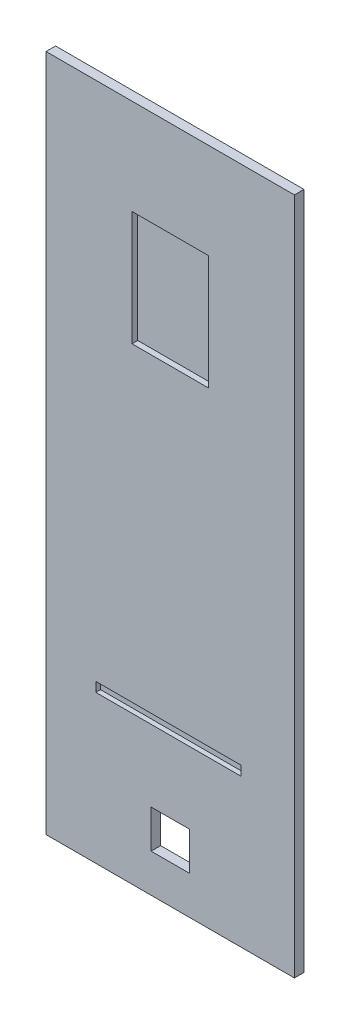
ISO-10303-21;
HEADER;
FILE_DESCRIPTION(('STEP AP214'),'2;1');
FILE_NAME('part.step','',(''),(''),'','','');
FILE_SCHEMA(('AUTOMOTIVE_DESIGN { 1 0 10303 214 1 1 1 1 }'));
ENDSEC;
DATA;
#1=APPLICATION_CONTEXT('core data for automotive mechanical design processes');
#2=APPLICATION_PROTOCOL_DEFINITION('international standard','automotive_design',2000,#1);
#3=PRODUCT_CONTEXT('',#1,'mechanical');
#4=PRODUCT('Part','Part','',(#3));
#5=PRODUCT_RELATED_PRODUCT_CATEGORY('part','',(#4));
#6=PRODUCT_DEFINITION_FORMATION('','',#4);
#7=PRODUCT_DEFINITION_CONTEXT('part definition',#1,'design');
#8=PRODUCT_DEFINITION('design','',#6,#7);
#9=PRODUCT_DEFINITION_SHAPE('','',#8);
#10=(LENGTH_UNIT() NAMED_UNIT(*) SI_UNIT(.MILLI.,.METRE.));
#11=(NAMED_UNIT(*) PLANE_ANGLE_UNIT() SI_UNIT($,.RADIAN.));
#12=(NAMED_UNIT(*) SI_UNIT($,.STERADIAN.) SOLID_ANGLE_UNIT());
#13=UNCERTAINTY_MEASURE_WITH_UNIT(LENGTH_MEASURE(1.E-05),#10,'distance_accuracy_value','');
#14=(GEOMETRIC_REPRESENTATION_CONTEXT(3) GLOBAL_UNCERTAINTY_ASSIGNED_CONTEXT((#13)) GLOBAL_UNIT_ASSIGNED_CONTEXT((#10,
#11,#12)) REPRESENTATION_CONTEXT('',''));
#15=CARTESIAN_POINT('',(0.,0.,0.));
#16=DIRECTION('',(0.,0.,1.));
#17=DIRECTION('',(1.,0.,0.));
#18=AXIS2_PLACEMENT_3D('',#15,#16,#17);
#19=CARTESIAN_POINT('',(0.,0.,12.7));
#20=DIRECTION('',(1.,0.,0.));
#21=DIRECTION('',(0.,0.,-1.));
#22=AXIS2_PLACEMENT_3D('',#19,#20,#21);
#23=PLANE('',#22);
#24=DIRECTION('',(0.,-1.,0.));
#25=VECTOR('',#24,1.);
#26=CARTESIAN_POINT('',(0.,0.,0.));
#27=LINE('',#26,#25);
#28=CARTESIAN_POINT('',(0.,901.7,0.));
#29=VERTEX_POINT('',#28);
#30=CARTESIAN_POINT('',(0.,0.,0.));
#31=VERTEX_POINT('',#30);
#32=EDGE_CURVE('E230',#29,#31,#27,.T.);
#33=ORIENTED_EDGE('',*,*,#32,.T.);
#34=DIRECTION('',(0.,0.,-1.));
#35=VECTOR('',#34,1.);
#36=CARTESIAN_POINT('',(0.,0.,12.7));
#37=LINE('',#36,#35);
#38=CARTESIAN_POINT('',(0.,0.,12.7));
#39=VERTEX_POINT('',#38);
#40=EDGE_CURVE('E263',#39,#31,#37,.T.);
#41=ORIENTED_EDGE('',*,*,#40,.F.);
#42=DIRECTION('',(0.,-1.,0.));
#43=VECTOR('',#42,1.);
#44=CARTESIAN_POINT('',(0.,0.,12.7));
#45=LINE('',#44,#43);
#46=CARTESIAN_POINT('',(0.,901.7,12.7));
#47=VERTEX_POINT('',#46);
#48=EDGE_CURVE('E237',#47,#39,#45,.T.);
#49=ORIENTED_EDGE('',*,*,#48,.F.);
#50=DIRECTION('',(0.,0.,-1.));
#51=VECTOR('',#50,1.);
#52=CARTESIAN_POINT('',(0.,901.7,12.7));
#53=LINE('',#52,#51);
#54=EDGE_CURVE('E247',#47,#29,#53,.T.);
#55=ORIENTED_EDGE('',*,*,#54,.T.);
#56=EDGE_LOOP('',(#33,#41,#49,#55));
#57=FACE_BOUND('',#56,.T.);
#58=ADVANCED_FACE('F32',(#57),#23,.F.);
#59=CARTESIAN_POINT('',(0.,0.,12.7));
#60=DIRECTION('',(0.,1.,0.));
#61=DIRECTION('',(0.,0.,1.));
#62=AXIS2_PLACEMENT_3D('',#59,#60,#61);
#63=PLANE('',#62);
#64=DIRECTION('',(1.,0.,0.));
#65=VECTOR('',#64,1.);
#66=CARTESIAN_POINT('',(0.,0.,0.));
#67=LINE('',#66,#65);
#68=CARTESIAN_POINT('',(330.2,0.,0.));
#69=VERTEX_POINT('',#68);
#70=EDGE_CURVE('E250',#31,#69,#67,.T.);
#71=ORIENTED_EDGE('',*,*,#70,.T.);
#72=DIRECTION('',(0.,0.,-1.));
#73=VECTOR('',#72,1.);
#74=CARTESIAN_POINT('',(330.2,0.,12.7));
#75=LINE('',#74,#73);
#76=CARTESIAN_POINT('',(330.2,0.,12.7));
#77=VERTEX_POINT('',#76);
#78=EDGE_CURVE('E260',#77,#69,#75,.T.);
#79=ORIENTED_EDGE('',*,*,#78,.F.);
#80=DIRECTION('',(1.,0.,0.));
#81=VECTOR('',#80,1.);
#82=CARTESIAN_POINT('',(0.,0.,12.7));
#83=LINE('',#82,#81);
#84=EDGE_CURVE('E240',#39,#77,#83,.T.);
#85=ORIENTED_EDGE('',*,*,#84,.F.);
#86=ORIENTED_EDGE('',*,*,#40,.T.);
#87=EDGE_LOOP('',(#71,#79,#85,#86));
#88=FACE_BOUND('',#87,.T.);
#89=ADVANCED_FACE('F287',(#88),#63,.F.);
#90=CARTESIAN_POINT('',(330.2,0.,12.7));
#91=DIRECTION('',(-1.,0.,0.));
#92=DIRECTION('',(0.,0.,1.));
#93=AXIS2_PLACEMENT_3D('',#90,#91,#92);
#94=PLANE('',#93);
#95=DIRECTION('',(0.,1.,0.));
#96=VECTOR('',#95,1.);
#97=CARTESIAN_POINT('',(330.2,0.,0.));
#98=LINE('',#97,#96);
#99=CARTESIAN_POINT('',(330.2,901.7,0.));
#100=VERTEX_POINT('',#99);
#101=EDGE_CURVE('E252',#69,#100,#98,.T.);
#102=ORIENTED_EDGE('',*,*,#101,.T.);
#103=DIRECTION('',(0.,0.,-1.));
#104=VECTOR('',#103,1.);
#105=CARTESIAN_POINT('',(330.2,901.7,12.7));
#106=LINE('',#105,#104);
#107=CARTESIAN_POINT('',(330.2,901.7,12.7));
#108=VERTEX_POINT('',#107);
#109=EDGE_CURVE('E257',#108,#100,#106,.T.);
#110=ORIENTED_EDGE('',*,*,#109,.F.);
#111=DIRECTION('',(0.,1.,0.));
#112=VECTOR('',#111,1.);
#113=CARTESIAN_POINT('',(330.2,0.,12.7));
#114=LINE('',#113,#112);
#115=EDGE_CURVE('E243',#77,#108,#114,.T.);
#116=ORIENTED_EDGE('',*,*,#115,.F.);
#117=ORIENTED_EDGE('',*,*,#78,.T.);
#118=EDGE_LOOP('',(#102,#110,#116,#117));
#119=FACE_BOUND('',#118,.T.);
#120=ADVANCED_FACE('F292',(#119),#94,.F.);
#121=CARTESIAN_POINT('',(0.,901.7,12.7));
#122=DIRECTION('',(0.,-1.,0.));
#123=DIRECTION('',(0.,0.,-1.));
#124=AXIS2_PLACEMENT_3D('',#121,#122,#123);
#125=PLANE('',#124);
#126=DIRECTION('',(-1.,0.,0.));
#127=VECTOR('',#126,1.);
#128=CARTESIAN_POINT('',(0.,901.7,0.));
#129=LINE('',#128,#127);
#130=EDGE_CURVE('E241',#100,#29,#129,.T.);
#131=ORIENTED_EDGE('',*,*,#130,.T.);
#132=ORIENTED_EDGE('',*,*,#54,.F.);
#133=DIRECTION('',(-1.,0.,0.));
#134=VECTOR('',#133,1.);
#135=CARTESIAN_POINT('',(0.,901.7,12.7));
#136=LINE('',#135,#134);
#137=EDGE_CURVE('E245',#108,#47,#136,.T.);
#138=ORIENTED_EDGE('',*,*,#137,.F.);
#139=ORIENTED_EDGE('',*,*,#109,.T.);
#140=EDGE_LOOP('',(#131,#132,#138,#139));
#141=FACE_BOUND('',#140,.T.);
#142=ADVANCED_FACE('F308',(#141),#125,.F.);
#143=CARTESIAN_POINT('',(0.,0.,12.7));
#144=DIRECTION('',(0.,0.,-1.));
#145=DIRECTION('',(-1.,0.,0.));
#146=AXIS2_PLACEMENT_3D('',#143,#144,#145);
#147=PLANE('',#146);
#148=DIRECTION('',(0.,-1.,0.));
#149=VECTOR('',#148,1.);
#150=CARTESIAN_POINT('',(66.0912776540956,0.,12.7));
#151=LINE('',#150,#149);
#152=CARTESIAN_POINT('',(66.0912776540956,209.55,12.7));
#153=VERTEX_POINT('',#152);
#154=CARTESIAN_POINT('',(66.0912776540956,196.85,12.7));
#155=VERTEX_POINT('',#154);
#156=EDGE_CURVE('E268',#153,#155,#151,.T.);
#157=ORIENTED_EDGE('',*,*,#156,.F.);
#158=DIRECTION('',(1.,0.,0.));
#159=VECTOR('',#158,1.);
#160=CARTESIAN_POINT('',(0.,209.55,12.7));
#161=LINE('',#160,#159);
#162=CARTESIAN_POINT('',(258.984591225424,209.55,12.7));
#163=VERTEX_POINT('',#162);
#164=EDGE_CURVE('E11',#153,#163,#161,.T.);
#165=ORIENTED_EDGE('',*,*,#164,.T.);
#166=DIRECTION('',(0.,1.,0.));
#167=VECTOR('',#166,1.);
#168=CARTESIAN_POINT('',(258.984591225424,0.,12.7));
#169=LINE('',#168,#167);
#170=CARTESIAN_POINT('',(258.984591225424,196.85,12.7));
#171=VERTEX_POINT('',#170);
#172=EDGE_CURVE('E39',#171,#163,#169,.T.);
#173=ORIENTED_EDGE('',*,*,#172,.F.);
#174=DIRECTION('',(1.,0.,0.));
#175=VECTOR('',#174,1.);
#176=CARTESIAN_POINT('',(0.,196.85,12.7));
#177=LINE('',#176,#175);
#178=EDGE_CURVE('E266',#155,#171,#177,.T.);
#179=ORIENTED_EDGE('',*,*,#178,.F.);
#180=EDGE_LOOP('',(#157,#165,#173,#179));
#181=FACE_BOUND('',#180,.T.);
#182=DIRECTION('',(1.,0.,0.));
#183=VECTOR('',#182,1.);
#184=CARTESIAN_POINT('',(139.7,50.8,12.7));
#185=LINE('',#184,#183);
#186=CARTESIAN_POINT('',(139.7,50.8,12.7));
#187=VERTEX_POINT('',#186);
#188=CARTESIAN_POINT('',(190.5,50.8,12.7));
#189=VERTEX_POINT('',#188);
#190=EDGE_CURVE('E189',#187,#189,#185,.T.);
#191=ORIENTED_EDGE('',*,*,#190,.F.);
#192=DIRECTION('',(0.,-1.,0.));
#193=VECTOR('',#192,1.);
#194=CARTESIAN_POINT('',(139.7,101.6,12.7));
#195=LINE('',#194,#193);
#196=CARTESIAN_POINT('',(139.7,101.6,12.7));
#197=VERTEX_POINT('',#196);
#198=EDGE_CURVE('E54',#197,#187,#195,.T.);
#199=ORIENTED_EDGE('',*,*,#198,.F.);
#200=DIRECTION('',(-1.,0.,0.));
#201=VECTOR('',#200,1.);
#202=CARTESIAN_POINT('',(139.7,101.6,12.7));
#203=LINE('',#202,#201);
#204=CARTESIAN_POINT('',(190.5,101.6,12.7));
#205=VERTEX_POINT('',#204);
#206=EDGE_CURVE('E178',#205,#197,#203,.T.);
#207=ORIENTED_EDGE('',*,*,#206,.F.);
#208=DIRECTION('',(0.,1.,0.));
#209=VECTOR('',#208,1.);
#210=CARTESIAN_POINT('',(190.5,101.6,12.7));
#211=LINE('',#210,#209);
#212=EDGE_CURVE('E192',#189,#205,#211,.T.);
#213=ORIENTED_EDGE('',*,*,#212,.F.);
#214=EDGE_LOOP('',(#191,#199,#207,#213));
#215=FACE_BOUND('',#214,.T.);
#216=DIRECTION('',(-1.,0.,0.));
#217=VECTOR('',#216,1.);
#218=CARTESIAN_POINT('',(114.3,774.7,12.7));
#219=LINE('',#218,#217);
#220=CARTESIAN_POINT('',(215.9,774.7,12.7));
#221=VERTEX_POINT('',#220);
#222=CARTESIAN_POINT('',(114.3,774.7,12.7));
#223=VERTEX_POINT('',#222);
#224=EDGE_CURVE('E220',#221,#223,#219,.T.);
#225=ORIENTED_EDGE('',*,*,#224,.F.);
#226=DIRECTION('',(0.,1.,0.));
#227=VECTOR('',#226,1.);
#228=CARTESIAN_POINT('',(215.9,774.7,12.7));
#229=LINE('',#228,#227);
#230=CARTESIAN_POINT('',(215.9,622.3,12.7));
#231=VERTEX_POINT('',#230);
#232=EDGE_CURVE('E199',#231,#221,#229,.T.);
#233=ORIENTED_EDGE('',*,*,#232,.F.);
#234=DIRECTION('',(1.,0.,0.));
#235=VECTOR('',#234,1.);
#236=CARTESIAN_POINT('',(114.3,622.3,12.7));
#237=LINE('',#236,#235);
#238=CARTESIAN_POINT('',(114.3,622.3,12.7));
#239=VERTEX_POINT('',#238);
#240=EDGE_CURVE('E209',#239,#231,#237,.T.);
#241=ORIENTED_EDGE('',*,*,#240,.F.);
#242=DIRECTION('',(0.,-1.,0.));
#243=VECTOR('',#242,1.);
#244=CARTESIAN_POINT('',(114.3,774.7,12.7));
#245=LINE('',#244,#243);
#246=EDGE_CURVE('E223',#223,#239,#245,.T.);
#247=ORIENTED_EDGE('',*,*,#246,.F.);
#248=EDGE_LOOP('',(#225,#233,#241,#247));
#249=FACE_BOUND('',#248,.T.);
#250=ORIENTED_EDGE('',*,*,#48,.T.);
#251=ORIENTED_EDGE('',*,*,#84,.T.);
#252=ORIENTED_EDGE('',*,*,#115,.T.);
#253=ORIENTED_EDGE('',*,*,#137,.T.);
#254=EDGE_LOOP('',(#250,#251,#252,#253));
#255=FACE_BOUND('',#254,.T.);
#256=ADVANCED_FACE('F274',(#181,#215,#249,#255),#147,.F.);
#257=CARTESIAN_POINT('',(0.,0.,0.));
#258=DIRECTION('',(0.,0.,-1.));
#259=DIRECTION('',(-1.,0.,0.));
#260=AXIS2_PLACEMENT_3D('',#257,#258,#259);
#261=PLANE('',#260);
#262=DIRECTION('',(0.,-1.,0.));
#263=VECTOR('',#262,1.);
#264=CARTESIAN_POINT('',(139.7,101.6,0.));
#265=LINE('',#264,#263);
#266=CARTESIAN_POINT('',(139.7,101.6,0.));
#267=VERTEX_POINT('',#266);
#268=CARTESIAN_POINT('',(139.7,50.8,0.));
#269=VERTEX_POINT('',#268);
#270=EDGE_CURVE('E174',#267,#269,#265,.T.);
#271=ORIENTED_EDGE('',*,*,#270,.T.);
#272=DIRECTION('',(1.,0.,0.));
#273=VECTOR('',#272,1.);
#274=CARTESIAN_POINT('',(139.7,50.8,0.));
#275=LINE('',#274,#273);
#276=CARTESIAN_POINT('',(190.5,50.8,0.));
#277=VERTEX_POINT('',#276);
#278=EDGE_CURVE('E177',#269,#277,#275,.T.);
#279=ORIENTED_EDGE('',*,*,#278,.T.);
#280=DIRECTION('',(0.,1.,0.));
#281=VECTOR('',#280,1.);
#282=CARTESIAN_POINT('',(190.5,101.6,0.));
#283=LINE('',#282,#281);
#284=CARTESIAN_POINT('',(190.5,101.6,0.));
#285=VERTEX_POINT('',#284);
#286=EDGE_CURVE('E181',#277,#285,#283,.T.);
#287=ORIENTED_EDGE('',*,*,#286,.T.);
#288=DIRECTION('',(-1.,0.,0.));
#289=VECTOR('',#288,1.);
#290=CARTESIAN_POINT('',(139.7,101.6,0.));
#291=LINE('',#290,#289);
#292=EDGE_CURVE('E184',#285,#267,#291,.T.);
#293=ORIENTED_EDGE('',*,*,#292,.T.);
#294=EDGE_LOOP('',(#271,#279,#287,#293));
#295=FACE_BOUND('',#294,.T.);
#296=ORIENTED_EDGE('',*,*,#32,.F.);
#297=ORIENTED_EDGE('',*,*,#130,.F.);
#298=ORIENTED_EDGE('',*,*,#101,.F.);
#299=ORIENTED_EDGE('',*,*,#70,.F.);
#300=EDGE_LOOP('',(#296,#297,#298,#299));
#301=FACE_BOUND('',#300,.T.);
#302=ADVANCED_FACE('F300',(#295,#301),#261,.T.);
#303=CARTESIAN_POINT('',(215.9,774.7,5.08));
#304=DIRECTION('',(1.,0.,0.));
#305=DIRECTION('',(0.,1.,0.));
#306=AXIS2_PLACEMENT_3D('',#303,#304,#305);
#307=PLANE('',#306);
#308=ORIENTED_EDGE('',*,*,#232,.T.);
#309=DIRECTION('',(0.,0.,1.));
#310=VECTOR('',#309,1.);
#311=CARTESIAN_POINT('',(215.9,774.7,5.08));
#312=LINE('',#311,#310);
#313=CARTESIAN_POINT('',(215.9,774.7,5.08));
#314=VERTEX_POINT('',#313);
#315=EDGE_CURVE('E218',#314,#221,#312,.T.);
#316=ORIENTED_EDGE('',*,*,#315,.F.);
#317=DIRECTION('',(0.,1.,0.));
#318=VECTOR('',#317,1.);
#319=CARTESIAN_POINT('',(215.9,774.7,5.08));
#320=LINE('',#319,#318);
#321=CARTESIAN_POINT('',(215.9,622.3,5.08));
#322=VERTEX_POINT('',#321);
#323=EDGE_CURVE('E205',#322,#314,#320,.T.);
#324=ORIENTED_EDGE('',*,*,#323,.F.);
#325=DIRECTION('',(0.,0.,1.));
#326=VECTOR('',#325,1.);
#327=CARTESIAN_POINT('',(215.9,622.3,5.08));
#328=LINE('',#327,#326);
#329=EDGE_CURVE('E228',#322,#231,#328,.T.);
#330=ORIENTED_EDGE('',*,*,#329,.T.);
#331=EDGE_LOOP('',(#308,#316,#324,#330));
#332=FACE_BOUND('',#331,.T.);
#333=ADVANCED_FACE('F319',(#332),#307,.F.);
#334=CARTESIAN_POINT('',(114.3,622.3,5.08));
#335=DIRECTION('',(0.,-1.,0.));
#336=DIRECTION('',(0.,0.,-1.));
#337=AXIS2_PLACEMENT_3D('',#334,#335,#336);
#338=PLANE('',#337);
#339=ORIENTED_EDGE('',*,*,#240,.T.);
#340=ORIENTED_EDGE('',*,*,#329,.F.);
#341=DIRECTION('',(1.,0.,0.));
#342=VECTOR('',#341,1.);
#343=CARTESIAN_POINT('',(114.3,622.3,5.08));
#344=LINE('',#343,#342);
#345=CARTESIAN_POINT('',(114.3,622.3,5.08));
#346=VERTEX_POINT('',#345);
#347=EDGE_CURVE('E215',#346,#322,#344,.T.);
#348=ORIENTED_EDGE('',*,*,#347,.F.);
#349=DIRECTION('',(0.,0.,1.));
#350=VECTOR('',#349,1.);
#351=CARTESIAN_POINT('',(114.3,622.3,5.08));
#352=LINE('',#351,#350);
#353=EDGE_CURVE('E231',#346,#239,#352,.T.);
#354=ORIENTED_EDGE('',*,*,#353,.T.);
#355=EDGE_LOOP('',(#339,#340,#348,#354));
#356=FACE_BOUND('',#355,.T.);
#357=ADVANCED_FACE('F325',(#356),#338,.F.);
#358=CARTESIAN_POINT('',(114.3,774.7,5.08));
#359=DIRECTION('',(-1.,0.,0.));
#360=DIRECTION('',(0.,-1.,0.));
#361=AXIS2_PLACEMENT_3D('',#358,#359,#360);
#362=PLANE('',#361);
#363=ORIENTED_EDGE('',*,*,#246,.T.);
#364=ORIENTED_EDGE('',*,*,#353,.F.);
#365=DIRECTION('',(0.,-1.,0.));
#366=VECTOR('',#365,1.);
#367=CARTESIAN_POINT('',(114.3,774.7,5.08));
#368=LINE('',#367,#366);
#369=CARTESIAN_POINT('',(114.3,774.7,5.08));
#370=VERTEX_POINT('',#369);
#371=EDGE_CURVE('E212',#370,#346,#368,.T.);
#372=ORIENTED_EDGE('',*,*,#371,.F.);
#373=DIRECTION('',(0.,0.,1.));
#374=VECTOR('',#373,1.);
#375=CARTESIAN_POINT('',(114.3,774.7,5.08));
#376=LINE('',#375,#374);
#377=EDGE_CURVE('E233',#370,#223,#376,.T.);
#378=ORIENTED_EDGE('',*,*,#377,.T.);
#379=EDGE_LOOP('',(#363,#364,#372,#378));
#380=FACE_BOUND('',#379,.T.);
#381=ADVANCED_FACE('F331',(#380),#362,.F.);
#382=CARTESIAN_POINT('',(114.3,774.7,5.08));
#383=DIRECTION('',(0.,1.,0.));
#384=DIRECTION('',(0.,0.,1.));
#385=AXIS2_PLACEMENT_3D('',#382,#383,#384);
#386=PLANE('',#385);
#387=ORIENTED_EDGE('',*,*,#224,.T.);
#388=ORIENTED_EDGE('',*,*,#377,.F.);
#389=DIRECTION('',(-1.,0.,0.));
#390=VECTOR('',#389,1.);
#391=CARTESIAN_POINT('',(114.3,774.7,5.08));
#392=LINE('',#391,#390);
#393=EDGE_CURVE('E208',#314,#370,#392,.T.);
#394=ORIENTED_EDGE('',*,*,#393,.F.);
#395=ORIENTED_EDGE('',*,*,#315,.T.);
#396=EDGE_LOOP('',(#387,#388,#394,#395));
#397=FACE_BOUND('',#396,.T.);
#398=ADVANCED_FACE('F327',(#397),#386,.F.);
#399=CARTESIAN_POINT('',(0.,0.,5.08));
#400=DIRECTION('',(0.,0.,1.));
#401=DIRECTION('',(1.,0.,0.));
#402=AXIS2_PLACEMENT_3D('',#399,#400,#401);
#403=PLANE('',#402);
#404=ORIENTED_EDGE('',*,*,#323,.T.);
#405=ORIENTED_EDGE('',*,*,#393,.T.);
#406=ORIENTED_EDGE('',*,*,#371,.T.);
#407=ORIENTED_EDGE('',*,*,#347,.T.);
#408=EDGE_LOOP('',(#404,#405,#406,#407));
#409=FACE_BOUND('',#408,.T.);
#410=ADVANCED_FACE('F330',(#409),#403,.T.);
#411=CARTESIAN_POINT('',(139.7,101.6,0.));
#412=DIRECTION('',(-1.,0.,0.));
#413=DIRECTION('',(0.,-1.,0.));
#414=AXIS2_PLACEMENT_3D('',#411,#412,#413);
#415=PLANE('',#414);
#416=ORIENTED_EDGE('',*,*,#198,.T.);
#417=DIRECTION('',(0.,0.,1.));
#418=VECTOR('',#417,1.);
#419=CARTESIAN_POINT('',(139.7,50.8,0.));
#420=LINE('',#419,#418);
#421=EDGE_CURVE('E187',#269,#187,#420,.T.);
#422=ORIENTED_EDGE('',*,*,#421,.F.);
#423=ORIENTED_EDGE('',*,*,#270,.F.);
#424=DIRECTION('',(0.,0.,1.));
#425=VECTOR('',#424,1.);
#426=CARTESIAN_POINT('',(139.7,101.6,0.));
#427=LINE('',#426,#425);
#428=EDGE_CURVE('E197',#267,#197,#427,.T.);
#429=ORIENTED_EDGE('',*,*,#428,.T.);
#430=EDGE_LOOP('',(#416,#422,#423,#429));
#431=FACE_BOUND('',#430,.T.);
#432=ADVANCED_FACE('F341',(#431),#415,.F.);
#433=CARTESIAN_POINT('',(139.7,101.6,0.));
#434=DIRECTION('',(0.,1.,0.));
#435=DIRECTION('',(0.,0.,1.));
#436=AXIS2_PLACEMENT_3D('',#433,#434,#435);
#437=PLANE('',#436);
#438=ORIENTED_EDGE('',*,*,#206,.T.);
#439=ORIENTED_EDGE('',*,*,#428,.F.);
#440=ORIENTED_EDGE('',*,*,#292,.F.);
#441=DIRECTION('',(0.,0.,1.));
#442=VECTOR('',#441,1.);
#443=CARTESIAN_POINT('',(190.5,101.6,0.));
#444=LINE('',#443,#442);
#445=EDGE_CURVE('E200',#285,#205,#444,.T.);
#446=ORIENTED_EDGE('',*,*,#445,.T.);
#447=EDGE_LOOP('',(#438,#439,#440,#446));
#448=FACE_BOUND('',#447,.T.);
#449=ADVANCED_FACE('F345',(#448),#437,.F.);
#450=CARTESIAN_POINT('',(190.5,101.6,0.));
#451=DIRECTION('',(1.,0.,0.));
#452=DIRECTION('',(0.,0.,-1.));
#453=AXIS2_PLACEMENT_3D('',#450,#451,#452);
#454=PLANE('',#453);
#455=ORIENTED_EDGE('',*,*,#212,.T.);
#456=ORIENTED_EDGE('',*,*,#445,.F.);
#457=ORIENTED_EDGE('',*,*,#286,.F.);
#458=DIRECTION('',(0.,0.,1.));
#459=VECTOR('',#458,1.);
#460=CARTESIAN_POINT('',(190.5,50.8,0.));
#461=LINE('',#460,#459);
#462=EDGE_CURVE('E202',#277,#189,#461,.T.);
#463=ORIENTED_EDGE('',*,*,#462,.T.);
#464=EDGE_LOOP('',(#455,#456,#457,#463));
#465=FACE_BOUND('',#464,.T.);
#466=ADVANCED_FACE('F349',(#465),#454,.F.);
#467=CARTESIAN_POINT('',(139.7,50.8,0.));
#468=DIRECTION('',(0.,-1.,0.));
#469=DIRECTION('',(0.,0.,-1.));
#470=AXIS2_PLACEMENT_3D('',#467,#468,#469);
#471=PLANE('',#470);
#472=ORIENTED_EDGE('',*,*,#190,.T.);
#473=ORIENTED_EDGE('',*,*,#462,.F.);
#474=ORIENTED_EDGE('',*,*,#278,.F.);
#475=ORIENTED_EDGE('',*,*,#421,.T.);
#476=EDGE_LOOP('',(#472,#473,#474,#475));
#477=FACE_BOUND('',#476,.T.);
#478=ADVANCED_FACE('F346',(#477),#471,.F.);
#479=CARTESIAN_POINT('',(258.984591225424,209.55,12.7481867422834));
#480=DIRECTION('',(-1.,0.,0.));
#481=DIRECTION('',(0.,1.,0.));
#482=AXIS2_PLACEMENT_3D('',#479,#480,#481);
#483=PLANE('',#482);
#484=ORIENTED_EDGE('',*,*,#172,.T.);
#485=DIRECTION('',(0.,0.,-1.));
#486=VECTOR('',#485,1.);
#487=CARTESIAN_POINT('',(258.984591225424,209.55,12.7481867422834));
#488=LINE('',#487,#486);
#489=CARTESIAN_POINT('',(258.984591225424,209.55,6.39818674228332));
#490=VERTEX_POINT('',#489);
#491=EDGE_CURVE('E144',#163,#490,#488,.T.);
#492=ORIENTED_EDGE('',*,*,#491,.T.);
#493=DIRECTION('',(0.,-1.,0.));
#494=VECTOR('',#493,1.);
#495=CARTESIAN_POINT('',(258.984591225424,209.55,6.39818674228332));
#496=LINE('',#495,#494);
#497=CARTESIAN_POINT('',(258.984591225424,196.85,6.39818674228332));
#498=VERTEX_POINT('',#497);
#499=EDGE_CURVE('E148',#490,#498,#496,.T.);
#500=ORIENTED_EDGE('',*,*,#499,.T.);
#501=DIRECTION('',(0.,0.,-1.));
#502=VECTOR('',#501,1.);
#503=CARTESIAN_POINT('',(258.984591225424,196.85,12.7481867422834));
#504=LINE('',#503,#502);
#505=EDGE_CURVE('E169',#171,#498,#504,.T.);
#506=ORIENTED_EDGE('',*,*,#505,.F.);
#507=EDGE_LOOP('',(#484,#492,#500,#506));
#508=FACE_BOUND('',#507,.T.);
#509=ADVANCED_FACE('F146',(#508),#483,.T.);
#510=CARTESIAN_POINT('',(66.0912776540956,209.55,12.7481867422834));
#511=DIRECTION('',(1.,0.,0.));
#512=DIRECTION('',(0.,0.,-1.));
#513=AXIS2_PLACEMENT_3D('',#510,#511,#512);
#514=PLANE('',#513);
#515=ORIENTED_EDGE('',*,*,#156,.T.);
#516=DIRECTION('',(0.,0.,1.));
#517=VECTOR('',#516,1.);
#518=CARTESIAN_POINT('',(66.0912776540956,196.85,12.7481867422834));
#519=LINE('',#518,#517);
#520=CARTESIAN_POINT('',(66.0912776540956,196.85,6.39818674228332));
#521=VERTEX_POINT('',#520);
#522=EDGE_CURVE('E46',#521,#155,#519,.T.);
#523=ORIENTED_EDGE('',*,*,#522,.F.);
#524=DIRECTION('',(0.,-1.,0.));
#525=VECTOR('',#524,1.);
#526=CARTESIAN_POINT('',(66.0912776540956,209.55,6.39818674228332));
#527=LINE('',#526,#525);
#528=CARTESIAN_POINT('',(66.0912776540956,209.55,6.39818674228332));
#529=VERTEX_POINT('',#528);
#530=EDGE_CURVE('E160',#529,#521,#527,.T.);
#531=ORIENTED_EDGE('',*,*,#530,.F.);
#532=DIRECTION('',(0.,0.,1.));
#533=VECTOR('',#532,1.);
#534=CARTESIAN_POINT('',(66.0912776540956,209.55,12.7481867422834));
#535=LINE('',#534,#533);
#536=EDGE_CURVE('E165',#529,#153,#535,.T.);
#537=ORIENTED_EDGE('',*,*,#536,.T.);
#538=EDGE_LOOP('',(#515,#523,#531,#537));
#539=FACE_BOUND('',#538,.T.);
#540=ADVANCED_FACE('F272',(#539),#514,.T.);
#541=CARTESIAN_POINT('',(-424.71544632442,209.55,1072.6673051735));
#542=DIRECTION('',(0.,1.,0.));
#543=DIRECTION('',(1.,0.,0.));
#544=AXIS2_PLACEMENT_3D('',#541,#542,#543);
#545=PLANE('',#544);
#546=ORIENTED_EDGE('',*,*,#536,.F.);
#547=DIRECTION('',(-1.,0.,0.));
#548=VECTOR('',#547,1.);
#549=CARTESIAN_POINT('',(258.984591225424,209.55,6.39818674228332));
#550=LINE('',#549,#548);
#551=EDGE_CURVE('E153',#490,#529,#550,.T.);
#552=ORIENTED_EDGE('',*,*,#551,.F.);
#553=ORIENTED_EDGE('',*,*,#491,.F.);
#554=ORIENTED_EDGE('',*,*,#164,.F.);
#555=EDGE_LOOP('',(#546,#552,#553,#554));
#556=FACE_BOUND('',#555,.T.);
#557=ADVANCED_FACE('F163',(#556),#545,.F.);
#558=CARTESIAN_POINT('',(-424.71544632442,196.85,1072.6673051735));
#559=DIRECTION('',(0.,1.,0.));
#560=DIRECTION('',(1.,0.,0.));
#561=AXIS2_PLACEMENT_3D('',#558,#559,#560);
#562=PLANE('',#561);
#563=ORIENTED_EDGE('',*,*,#178,.T.);
#564=ORIENTED_EDGE('',*,*,#505,.T.);
#565=DIRECTION('',(-1.,0.,0.));
#566=VECTOR('',#565,1.);
#567=CARTESIAN_POINT('',(258.984591225424,196.85,6.39818674228332));
#568=LINE('',#567,#566);
#569=EDGE_CURVE('E159',#498,#521,#568,.T.);
#570=ORIENTED_EDGE('',*,*,#569,.T.);
#571=ORIENTED_EDGE('',*,*,#522,.T.);
#572=EDGE_LOOP('',(#563,#564,#570,#571));
#573=FACE_BOUND('',#572,.T.);
#574=ADVANCED_FACE('F276',(#573),#562,.T.);
#575=CARTESIAN_POINT('',(258.984591225424,209.55,6.39818674228332));
#576=DIRECTION('',(0.,0.,1.));
#577=DIRECTION('',(0.,-1.,0.));
#578=AXIS2_PLACEMENT_3D('',#575,#576,#577);
#579=PLANE('',#578);
#580=ORIENTED_EDGE('',*,*,#569,.F.);
#581=ORIENTED_EDGE('',*,*,#499,.F.);
#582=ORIENTED_EDGE('',*,*,#551,.T.);
#583=ORIENTED_EDGE('',*,*,#530,.T.);
#584=EDGE_LOOP('',(#580,#581,#582,#583));
#585=FACE_BOUND('',#584,.T.);
#586=ADVANCED_FACE('F156',(#585),#579,.T.);
#587=CLOSED_SHELL('',(#58,#89,#120,#142,#256,#302,#333,#357,#381,#398,#410,#432,#449,#466,#478,
#509,#540,#557,#574,#586));
#588=MANIFOLD_SOLID_BREP('B2',#587);
#589=ADVANCED_BREP_SHAPE_REPRESENTATION('',(#18,#588),#14);
#590=SHAPE_DEFINITION_REPRESENTATION(#9,#589);
ENDSEC;
END-ISO-10303-21;
